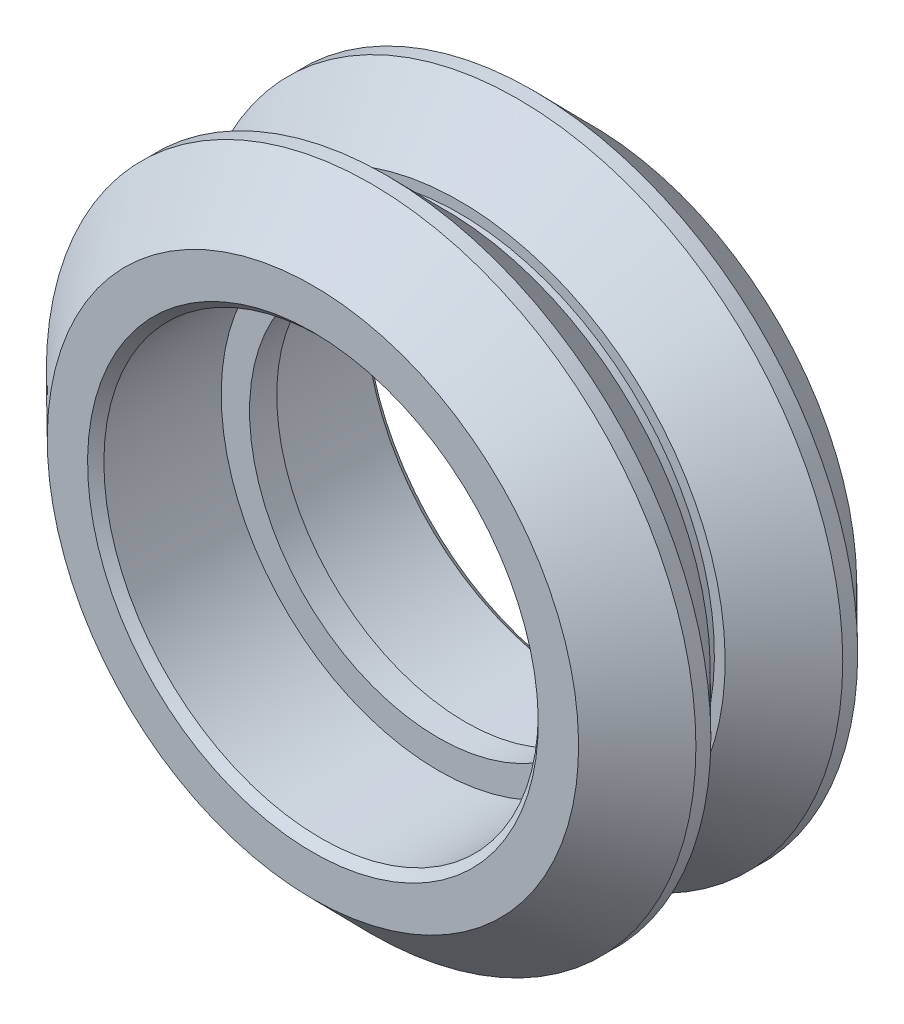
ISO-10303-21;
HEADER;
FILE_DESCRIPTION(('STEP AP214'),'2;1');
FILE_NAME('part.step','',(''),(''),'','','');
FILE_SCHEMA(('AUTOMOTIVE_DESIGN { 1 0 10303 214 1 1 1 1 }'));
ENDSEC;
DATA;
#1=APPLICATION_CONTEXT('core data for automotive mechanical design processes');
#2=APPLICATION_PROTOCOL_DEFINITION('international standard','automotive_design',2000,#1);
#3=PRODUCT_CONTEXT('',#1,'mechanical');
#4=PRODUCT('Part','Part','',(#3));
#5=PRODUCT_RELATED_PRODUCT_CATEGORY('part','',(#4));
#6=PRODUCT_DEFINITION_FORMATION('','',#4);
#7=PRODUCT_DEFINITION_CONTEXT('part definition',#1,'design');
#8=PRODUCT_DEFINITION('design','',#6,#7);
#9=PRODUCT_DEFINITION_SHAPE('','',#8);
#10=(LENGTH_UNIT() NAMED_UNIT(*) SI_UNIT(.MILLI.,.METRE.));
#11=(NAMED_UNIT(*) PLANE_ANGLE_UNIT() SI_UNIT($,.RADIAN.));
#12=(NAMED_UNIT(*) SI_UNIT($,.STERADIAN.) SOLID_ANGLE_UNIT());
#13=UNCERTAINTY_MEASURE_WITH_UNIT(LENGTH_MEASURE(1.E-05),#10,'distance_accuracy_value','');
#14=(GEOMETRIC_REPRESENTATION_CONTEXT(3) GLOBAL_UNCERTAINTY_ASSIGNED_CONTEXT((#13)) GLOBAL_UNIT_ASSIGNED_CONTEXT((#10,
#11,#12)) REPRESENTATION_CONTEXT('',''));
#15=CARTESIAN_POINT('',(0.,0.,0.));
#16=DIRECTION('',(0.,0.,1.));
#17=DIRECTION('',(1.,0.,0.));
#18=AXIS2_PLACEMENT_3D('',#15,#16,#17);
#19=CARTESIAN_POINT('',(0.,0.,5.115));
#20=DIRECTION('',(0.,0.,1.));
#21=DIRECTION('',(0.,-1.,0.));
#22=AXIS2_PLACEMENT_3D('',#19,#20,#21);
#23=CYLINDRICAL_SURFACE('',#22,7.987);
#24=CARTESIAN_POINT('',(0.,0.,4.815));
#25=DIRECTION('',(0.,0.,-1.));
#26=DIRECTION('',(0.,1.,0.));
#27=AXIS2_PLACEMENT_3D('',#24,#25,#26);
#28=CIRCLE('',#27,7.987);
#29=CARTESIAN_POINT('',(0.,7.987,4.815));
#30=VERTEX_POINT('',#29);
#31=EDGE_CURVE('E48',#30,#30,#28,.F.);
#32=ORIENTED_EDGE('',*,*,#31,.T.);
#33=EDGE_LOOP('',(#32));
#34=FACE_BOUND('',#33,.T.);
#35=CARTESIAN_POINT('',(0.,0.,0.499999999999998));
#36=DIRECTION('',(0.,0.,1.));
#37=DIRECTION('',(0.,-1.,0.));
#38=AXIS2_PLACEMENT_3D('',#35,#36,#37);
#39=CIRCLE('',#38,7.987);
#40=CARTESIAN_POINT('',(0.,-7.987,0.499999999999996));
#41=VERTEX_POINT('',#40);
#42=EDGE_CURVE('E92',#41,#41,#39,.T.);
#43=ORIENTED_EDGE('',*,*,#42,.F.);
#44=EDGE_LOOP('',(#43));
#45=FACE_BOUND('',#44,.T.);
#46=ADVANCED_FACE('F33',(#34,#45),#23,.F.);
#47=CARTESIAN_POINT('',(0.,9.77,5.115));
#48=DIRECTION('',(0.,0.,-1.));
#49=DIRECTION('',(0.,1.,0.));
#50=AXIS2_PLACEMENT_3D('',#47,#48,#49);
#51=PLANE('',#50);
#52=CARTESIAN_POINT('',(0.,0.,5.115));
#53=DIRECTION('',(0.,0.,-1.));
#54=DIRECTION('',(0.,1.,0.));
#55=AXIS2_PLACEMENT_3D('',#52,#53,#54);
#56=CIRCLE('',#55,8.287);
#57=CARTESIAN_POINT('',(0.,8.287,5.115));
#58=VERTEX_POINT('',#57);
#59=EDGE_CURVE('E44',#58,#58,#56,.T.);
#60=ORIENTED_EDGE('',*,*,#59,.T.);
#61=EDGE_LOOP('',(#60));
#62=FACE_BOUND('',#61,.T.);
#63=CARTESIAN_POINT('',(0.,0.,5.115));
#64=DIRECTION('',(0.,0.,1.));
#65=DIRECTION('',(0.,-1.,0.));
#66=AXIS2_PLACEMENT_3D('',#63,#64,#65);
#67=CIRCLE('',#66,9.77);
#68=CARTESIAN_POINT('',(0.,-9.77,5.115));
#69=VERTEX_POINT('',#68);
#70=EDGE_CURVE('E53',#69,#69,#67,.T.);
#71=ORIENTED_EDGE('',*,*,#70,.T.);
#72=EDGE_LOOP('',(#71));
#73=FACE_BOUND('',#72,.T.);
#74=ADVANCED_FACE('F99',(#62,#73),#51,.F.);
#75=CARTESIAN_POINT('',(0.,0.,2.975));
#76=DIRECTION('',(0.,0.,-1.));
#77=DIRECTION('',(0.,1.,0.));
#78=AXIS2_PLACEMENT_3D('',#75,#76,#77);
#79=CONICAL_SURFACE('',#78,11.945,0.79350922537995);
#80=ORIENTED_EDGE('',*,*,#70,.F.);
#81=EDGE_LOOP('',(#80));
#82=FACE_BOUND('',#81,.T.);
#83=CARTESIAN_POINT('',(0.,0.,2.975));
#84=DIRECTION('',(0.,0.,1.));
#85=DIRECTION('',(0.,-1.,0.));
#86=AXIS2_PLACEMENT_3D('',#83,#84,#85);
#87=CIRCLE('',#86,11.945);
#88=CARTESIAN_POINT('',(0.,-11.945,2.975));
#89=VERTEX_POINT('',#88);
#90=EDGE_CURVE('E56',#89,#89,#87,.T.);
#91=ORIENTED_EDGE('',*,*,#90,.T.);
#92=EDGE_LOOP('',(#91));
#93=FACE_BOUND('',#92,.T.);
#94=ADVANCED_FACE('F105',(#82,#93),#79,.T.);
#95=CARTESIAN_POINT('',(0.,0.,5.115));
#96=DIRECTION('',(0.,0.,1.));
#97=DIRECTION('',(0.,-1.,0.));
#98=AXIS2_PLACEMENT_3D('',#95,#96,#97);
#99=CYLINDRICAL_SURFACE('',#98,11.945);
#100=ORIENTED_EDGE('',*,*,#90,.F.);
#101=EDGE_LOOP('',(#100));
#102=FACE_BOUND('',#101,.T.);
#103=CARTESIAN_POINT('',(0.,0.,2.425));
#104=DIRECTION('',(0.,0.,1.));
#105=DIRECTION('',(0.,-1.,0.));
#106=AXIS2_PLACEMENT_3D('',#103,#104,#105);
#107=CIRCLE('',#106,11.945);
#108=CARTESIAN_POINT('',(0.,-11.945,2.425));
#109=VERTEX_POINT('',#108);
#110=EDGE_CURVE('E59',#109,#109,#107,.T.);
#111=ORIENTED_EDGE('',*,*,#110,.T.);
#112=EDGE_LOOP('',(#111));
#113=FACE_BOUND('',#112,.T.);
#114=ADVANCED_FACE('F128',(#102,#113),#99,.T.);
#115=CARTESIAN_POINT('',(0.,0.,0.274999999999998));
#116=DIRECTION('',(0.,0.,1.));
#117=DIRECTION('',(0.,-1.,0.));
#118=AXIS2_PLACEMENT_3D('',#115,#116,#117);
#119=CONICAL_SURFACE('',#118,9.77,0.791178445841111);
#120=ORIENTED_EDGE('',*,*,#110,.F.);
#121=EDGE_LOOP('',(#120));
#122=FACE_BOUND('',#121,.T.);
#123=CARTESIAN_POINT('',(0.,0.,0.274999999999998));
#124=DIRECTION('',(0.,0.,1.));
#125=DIRECTION('',(0.,-1.,0.));
#126=AXIS2_PLACEMENT_3D('',#123,#124,#125);
#127=CIRCLE('',#126,9.77);
#128=CARTESIAN_POINT('',(0.,-9.77,0.274999999999997));
#129=VERTEX_POINT('',#128);
#130=EDGE_CURVE('E62',#129,#129,#127,.T.);
#131=ORIENTED_EDGE('',*,*,#130,.T.);
#132=EDGE_LOOP('',(#131));
#133=FACE_BOUND('',#132,.T.);
#134=ADVANCED_FACE('F133',(#122,#133),#119,.T.);
#135=CARTESIAN_POINT('',(0.,9.77,0.275));
#136=DIRECTION('',(0.,0.,1.));
#137=DIRECTION('',(0.,-1.,0.));
#138=AXIS2_PLACEMENT_3D('',#135,#136,#137);
#139=PLANE('',#138);
#140=ORIENTED_EDGE('',*,*,#130,.F.);
#141=EDGE_LOOP('',(#140));
#142=FACE_BOUND('',#141,.T.);
#143=CARTESIAN_POINT('',(0.,0.,0.274999999999998));
#144=DIRECTION('',(0.,0.,1.));
#145=DIRECTION('',(0.,-1.,0.));
#146=AXIS2_PLACEMENT_3D('',#143,#144,#145);
#147=CIRCLE('',#146,9.375);
#148=CARTESIAN_POINT('',(0.,-9.375,0.274999999999997));
#149=VERTEX_POINT('',#148);
#150=EDGE_CURVE('E65',#149,#149,#147,.T.);
#151=ORIENTED_EDGE('',*,*,#150,.T.);
#152=EDGE_LOOP('',(#151));
#153=FACE_BOUND('',#152,.T.);
#154=ADVANCED_FACE('F139',(#142,#153),#139,.F.);
#155=CARTESIAN_POINT('',(0.,0.,5.115));
#156=DIRECTION('',(0.,0.,1.));
#157=DIRECTION('',(0.,-1.,0.));
#158=AXIS2_PLACEMENT_3D('',#155,#156,#157);
#159=CYLINDRICAL_SURFACE('',#158,9.375);
#160=ORIENTED_EDGE('',*,*,#150,.F.);
#161=EDGE_LOOP('',(#160));
#162=FACE_BOUND('',#161,.T.);
#163=CARTESIAN_POINT('',(0.,0.,-0.275000000000002));
#164=DIRECTION('',(0.,0.,1.));
#165=DIRECTION('',(0.,-1.,0.));
#166=AXIS2_PLACEMENT_3D('',#163,#164,#165);
#167=CIRCLE('',#166,9.375);
#168=CARTESIAN_POINT('',(0.,-9.375,-0.275000000000004));
#169=VERTEX_POINT('',#168);
#170=EDGE_CURVE('E68',#169,#169,#167,.T.);
#171=ORIENTED_EDGE('',*,*,#170,.T.);
#172=EDGE_LOOP('',(#171));
#173=FACE_BOUND('',#172,.T.);
#174=ADVANCED_FACE('F145',(#162,#173),#159,.T.);
#175=CARTESIAN_POINT('',(0.,9.77,-0.275));
#176=DIRECTION('',(0.,0.,-1.));
#177=DIRECTION('',(0.,1.,0.));
#178=AXIS2_PLACEMENT_3D('',#175,#176,#177);
#179=PLANE('',#178);
#180=ORIENTED_EDGE('',*,*,#170,.F.);
#181=EDGE_LOOP('',(#180));
#182=FACE_BOUND('',#181,.T.);
#183=CARTESIAN_POINT('',(0.,0.,-0.275000000000002));
#184=DIRECTION('',(0.,0.,1.));
#185=DIRECTION('',(0.,-1.,0.));
#186=AXIS2_PLACEMENT_3D('',#183,#184,#185);
#187=CIRCLE('',#186,9.77);
#188=CARTESIAN_POINT('',(0.,-9.77,-0.275000000000004));
#189=VERTEX_POINT('',#188);
#190=EDGE_CURVE('E71',#189,#189,#187,.T.);
#191=ORIENTED_EDGE('',*,*,#190,.T.);
#192=EDGE_LOOP('',(#191));
#193=FACE_BOUND('',#192,.T.);
#194=ADVANCED_FACE('F151',(#182,#193),#179,.F.);
#195=CARTESIAN_POINT('',(0.,0.,-2.425));
#196=DIRECTION('',(0.,0.,-1.));
#197=DIRECTION('',(0.,1.,0.));
#198=AXIS2_PLACEMENT_3D('',#195,#196,#197);
#199=CONICAL_SURFACE('',#198,11.945,0.791178445841111);
#200=ORIENTED_EDGE('',*,*,#190,.F.);
#201=EDGE_LOOP('',(#200));
#202=FACE_BOUND('',#201,.T.);
#203=CARTESIAN_POINT('',(0.,0.,-2.425));
#204=DIRECTION('',(0.,0.,1.));
#205=DIRECTION('',(0.,-1.,0.));
#206=AXIS2_PLACEMENT_3D('',#203,#204,#205);
#207=CIRCLE('',#206,11.945);
#208=CARTESIAN_POINT('',(0.,-11.945,-2.425));
#209=VERTEX_POINT('',#208);
#210=EDGE_CURVE('E74',#209,#209,#207,.T.);
#211=ORIENTED_EDGE('',*,*,#210,.T.);
#212=EDGE_LOOP('',(#211));
#213=FACE_BOUND('',#212,.T.);
#214=ADVANCED_FACE('F157',(#202,#213),#199,.T.);
#215=CARTESIAN_POINT('',(0.,0.,5.115));
#216=DIRECTION('',(0.,0.,1.));
#217=DIRECTION('',(0.,-1.,0.));
#218=AXIS2_PLACEMENT_3D('',#215,#216,#217);
#219=CYLINDRICAL_SURFACE('',#218,11.945);
#220=ORIENTED_EDGE('',*,*,#210,.F.);
#221=EDGE_LOOP('',(#220));
#222=FACE_BOUND('',#221,.T.);
#223=CARTESIAN_POINT('',(0.,0.,-2.975));
#224=DIRECTION('',(0.,0.,1.));
#225=DIRECTION('',(0.,-1.,0.));
#226=AXIS2_PLACEMENT_3D('',#223,#224,#225);
#227=CIRCLE('',#226,11.945);
#228=CARTESIAN_POINT('',(0.,-11.945,-2.975));
#229=VERTEX_POINT('',#228);
#230=EDGE_CURVE('E77',#229,#229,#227,.T.);
#231=ORIENTED_EDGE('',*,*,#230,.T.);
#232=EDGE_LOOP('',(#231));
#233=FACE_BOUND('',#232,.T.);
#234=ADVANCED_FACE('F163',(#222,#233),#219,.T.);
#235=CARTESIAN_POINT('',(0.,0.,-5.115));
#236=DIRECTION('',(0.,0.,1.));
#237=DIRECTION('',(0.,-1.,0.));
#238=AXIS2_PLACEMENT_3D('',#235,#236,#237);
#239=CONICAL_SURFACE('',#238,9.77,0.79350922537995);
#240=ORIENTED_EDGE('',*,*,#230,.F.);
#241=EDGE_LOOP('',(#240));
#242=FACE_BOUND('',#241,.T.);
#243=CARTESIAN_POINT('',(0.,0.,-5.115));
#244=DIRECTION('',(0.,0.,1.));
#245=DIRECTION('',(0.,-1.,0.));
#246=AXIS2_PLACEMENT_3D('',#243,#244,#245);
#247=CIRCLE('',#246,9.77);
#248=CARTESIAN_POINT('',(0.,-9.77,-5.115));
#249=VERTEX_POINT('',#248);
#250=EDGE_CURVE('E80',#249,#249,#247,.T.);
#251=ORIENTED_EDGE('',*,*,#250,.T.);
#252=EDGE_LOOP('',(#251));
#253=FACE_BOUND('',#252,.T.);
#254=ADVANCED_FACE('F169',(#242,#253),#239,.T.);
#255=CARTESIAN_POINT('',(0.,9.77,-5.115));
#256=DIRECTION('',(0.,0.,1.));
#257=DIRECTION('',(0.,-1.,0.));
#258=AXIS2_PLACEMENT_3D('',#255,#256,#257);
#259=PLANE('',#258);
#260=CARTESIAN_POINT('',(0.,0.,-5.115));
#261=DIRECTION('',(0.,0.,1.));
#262=DIRECTION('',(0.,-1.,0.));
#263=AXIS2_PLACEMENT_3D('',#260,#261,#262);
#264=CIRCLE('',#263,8.28700000000001);
#265=CARTESIAN_POINT('',(0.,-8.287,-5.115));
#266=VERTEX_POINT('',#265);
#267=EDGE_CURVE('E40',#266,#266,#264,.T.);
#268=ORIENTED_EDGE('',*,*,#267,.T.);
#269=EDGE_LOOP('',(#268));
#270=FACE_BOUND('',#269,.T.);
#271=ORIENTED_EDGE('',*,*,#250,.F.);
#272=EDGE_LOOP('',(#271));
#273=FACE_BOUND('',#272,.T.);
#274=ADVANCED_FACE('F175',(#270,#273),#259,.F.);
#275=CARTESIAN_POINT('',(0.,0.,5.115));
#276=DIRECTION('',(0.,0.,1.));
#277=DIRECTION('',(0.,-1.,0.));
#278=AXIS2_PLACEMENT_3D('',#275,#276,#277);
#279=CYLINDRICAL_SURFACE('',#278,7.987);
#280=CARTESIAN_POINT('',(0.,0.,-4.815));
#281=DIRECTION('',(0.,0.,1.));
#282=DIRECTION('',(0.,-1.,0.));
#283=AXIS2_PLACEMENT_3D('',#280,#281,#282);
#284=CIRCLE('',#283,7.987);
#285=CARTESIAN_POINT('',(0.,-7.987,-4.815));
#286=VERTEX_POINT('',#285);
#287=EDGE_CURVE('E10',#286,#286,#284,.F.);
#288=ORIENTED_EDGE('',*,*,#287,.T.);
#289=EDGE_LOOP('',(#288));
#290=FACE_BOUND('',#289,.T.);
#291=CARTESIAN_POINT('',(0.,0.,-0.500000000000001));
#292=DIRECTION('',(0.,0.,1.));
#293=DIRECTION('',(0.,-1.,0.));
#294=AXIS2_PLACEMENT_3D('',#291,#292,#293);
#295=CIRCLE('',#294,7.987);
#296=CARTESIAN_POINT('',(0.,-7.987,-0.500000000000003));
#297=VERTEX_POINT('',#296);
#298=EDGE_CURVE('E83',#297,#297,#295,.T.);
#299=ORIENTED_EDGE('',*,*,#298,.T.);
#300=EDGE_LOOP('',(#299));
#301=FACE_BOUND('',#300,.T.);
#302=ADVANCED_FACE('F180',(#290,#301),#279,.F.);
#303=CARTESIAN_POINT('',(0.,7.987,-0.5));
#304=DIRECTION('',(0.,0.,1.));
#305=DIRECTION('',(0.,-1.,0.));
#306=AXIS2_PLACEMENT_3D('',#303,#304,#305);
#307=PLANE('',#306);
#308=ORIENTED_EDGE('',*,*,#298,.F.);
#309=EDGE_LOOP('',(#308));
#310=FACE_BOUND('',#309,.T.);
#311=CARTESIAN_POINT('',(0.,0.,-0.500000000000002));
#312=DIRECTION('',(0.,0.,1.));
#313=DIRECTION('',(0.,-1.,0.));
#314=AXIS2_PLACEMENT_3D('',#311,#312,#313);
#315=CIRCLE('',#314,6.945);
#316=CARTESIAN_POINT('',(0.,-6.945,-0.500000000000003));
#317=VERTEX_POINT('',#316);
#318=EDGE_CURVE('E86',#317,#317,#315,.T.);
#319=ORIENTED_EDGE('',*,*,#318,.T.);
#320=EDGE_LOOP('',(#319));
#321=FACE_BOUND('',#320,.T.);
#322=ADVANCED_FACE('F185',(#310,#321),#307,.F.);
#323=CARTESIAN_POINT('',(0.,0.,5.115));
#324=DIRECTION('',(0.,0.,1.));
#325=DIRECTION('',(0.,-1.,0.));
#326=AXIS2_PLACEMENT_3D('',#323,#324,#325);
#327=CYLINDRICAL_SURFACE('',#326,6.945);
#328=ORIENTED_EDGE('',*,*,#318,.F.);
#329=EDGE_LOOP('',(#328));
#330=FACE_BOUND('',#329,.T.);
#331=CARTESIAN_POINT('',(0.,0.,0.499999999999999));
#332=DIRECTION('',(0.,0.,1.));
#333=DIRECTION('',(0.,-1.,0.));
#334=AXIS2_PLACEMENT_3D('',#331,#332,#333);
#335=CIRCLE('',#334,6.945);
#336=CARTESIAN_POINT('',(0.,-6.945,0.499999999999997));
#337=VERTEX_POINT('',#336);
#338=EDGE_CURVE('E89',#337,#337,#335,.T.);
#339=ORIENTED_EDGE('',*,*,#338,.T.);
#340=EDGE_LOOP('',(#339));
#341=FACE_BOUND('',#340,.T.);
#342=ADVANCED_FACE('F117',(#330,#341),#327,.F.);
#343=CARTESIAN_POINT('',(0.,7.987,0.5));
#344=DIRECTION('',(0.,0.,-1.));
#345=DIRECTION('',(0.,1.,0.));
#346=AXIS2_PLACEMENT_3D('',#343,#344,#345);
#347=PLANE('',#346);
#348=ORIENTED_EDGE('',*,*,#338,.F.);
#349=EDGE_LOOP('',(#348));
#350=FACE_BOUND('',#349,.T.);
#351=ORIENTED_EDGE('',*,*,#42,.T.);
#352=EDGE_LOOP('',(#351));
#353=FACE_BOUND('',#352,.T.);
#354=ADVANCED_FACE('F96',(#350,#353),#347,.F.);
#355=CARTESIAN_POINT('',(0.,0.,4.815));
#356=DIRECTION('',(0.,0.,1.));
#357=DIRECTION('',(0.,-1.,0.));
#358=AXIS2_PLACEMENT_3D('',#355,#356,#357);
#359=CONICAL_SURFACE('',#358,7.987,0.78539816339746);
#360=ORIENTED_EDGE('',*,*,#59,.F.);
#361=EDGE_LOOP('',(#360));
#362=FACE_BOUND('',#361,.T.);
#363=ORIENTED_EDGE('',*,*,#31,.F.);
#364=EDGE_LOOP('',(#363));
#365=FACE_BOUND('',#364,.T.);
#366=ADVANCED_FACE('F109',(#362,#365),#359,.F.);
#367=CARTESIAN_POINT('',(0.,0.,-5.115));
#368=DIRECTION('',(0.,0.,-1.));
#369=DIRECTION('',(0.,1.,0.));
#370=AXIS2_PLACEMENT_3D('',#367,#368,#369);
#371=CONICAL_SURFACE('',#370,8.28700000000001,0.785398163397448);
#372=ORIENTED_EDGE('',*,*,#287,.F.);
#373=EDGE_LOOP('',(#372));
#374=FACE_BOUND('',#373,.T.);
#375=ORIENTED_EDGE('',*,*,#267,.F.);
#376=EDGE_LOOP('',(#375));
#377=FACE_BOUND('',#376,.T.);
#378=ADVANCED_FACE('F35',(#374,#377),#371,.F.);
#379=CLOSED_SHELL('',(#46,#74,#94,#114,#134,#154,#174,#194,#214,#234,#254,#274,#302,#322,#342,
#354,#366,#378));
#380=MANIFOLD_SOLID_BREP('B2',#379);
#381=ADVANCED_BREP_SHAPE_REPRESENTATION('',(#18,#380),#14);
#382=SHAPE_DEFINITION_REPRESENTATION(#9,#381);
ENDSEC;
END-ISO-10303-21;
